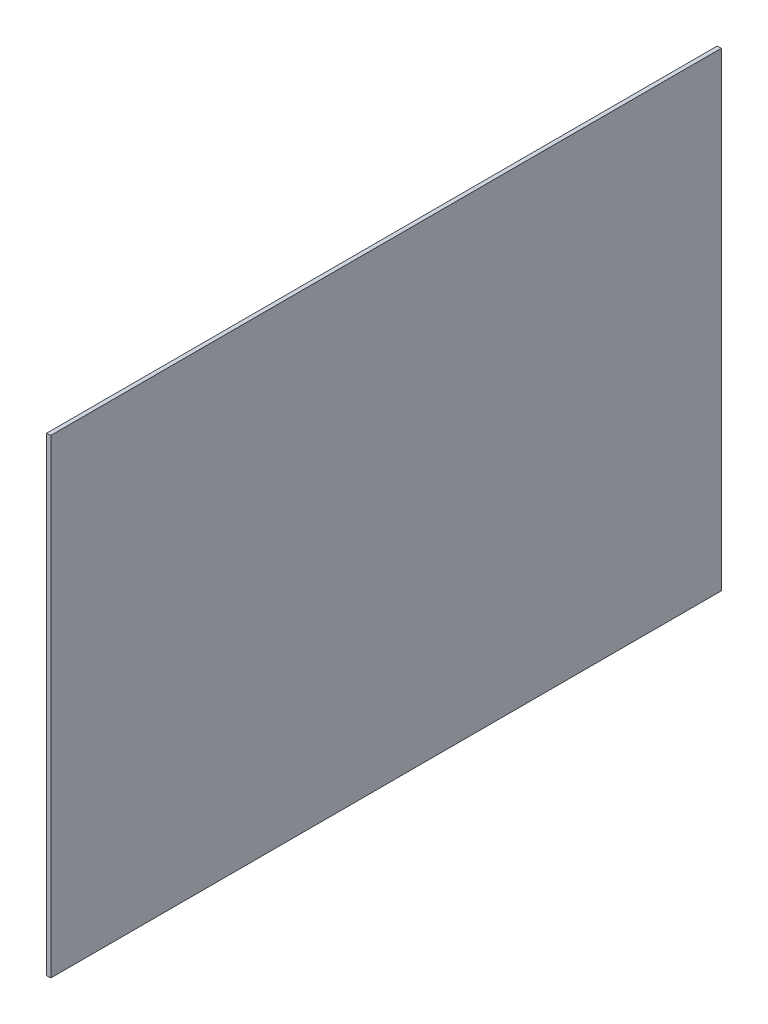
ISO-10303-21;
HEADER;
FILE_DESCRIPTION(('STEP AP214'),'2;1');
FILE_NAME('part.step','',(''),(''),'','','');
FILE_SCHEMA(('AUTOMOTIVE_DESIGN { 1 0 10303 214 1 1 1 1 }'));
ENDSEC;
DATA;
#1=APPLICATION_CONTEXT('core data for automotive mechanical design processes');
#2=APPLICATION_PROTOCOL_DEFINITION('international standard','automotive_design',2000,#1);
#3=PRODUCT_CONTEXT('',#1,'mechanical');
#4=PRODUCT('Part','Part','',(#3));
#5=PRODUCT_RELATED_PRODUCT_CATEGORY('part','',(#4));
#6=PRODUCT_DEFINITION_FORMATION('','',#4);
#7=PRODUCT_DEFINITION_CONTEXT('part definition',#1,'design');
#8=PRODUCT_DEFINITION('design','',#6,#7);
#9=PRODUCT_DEFINITION_SHAPE('','',#8);
#10=(LENGTH_UNIT() NAMED_UNIT(*) SI_UNIT(.MILLI.,.METRE.));
#11=(NAMED_UNIT(*) PLANE_ANGLE_UNIT() SI_UNIT($,.RADIAN.));
#12=(NAMED_UNIT(*) SI_UNIT($,.STERADIAN.) SOLID_ANGLE_UNIT());
#13=UNCERTAINTY_MEASURE_WITH_UNIT(LENGTH_MEASURE(1.E-05),#10,'distance_accuracy_value','');
#14=(GEOMETRIC_REPRESENTATION_CONTEXT(3) GLOBAL_UNCERTAINTY_ASSIGNED_CONTEXT((#13)) GLOBAL_UNIT_ASSIGNED_CONTEXT((#10,
#11,#12)) REPRESENTATION_CONTEXT('',''));
#15=CARTESIAN_POINT('',(0.,0.,0.));
#16=DIRECTION('',(0.,0.,1.));
#17=DIRECTION('',(1.,0.,0.));
#18=AXIS2_PLACEMENT_3D('',#15,#16,#17);
#19=CARTESIAN_POINT('',(3.,175.205305412168,-250.));
#20=DIRECTION('',(0.,-1.,0.));
#21=DIRECTION('',(0.,0.,-1.));
#22=AXIS2_PLACEMENT_3D('',#19,#20,#21);
#23=PLANE('',#22);
#24=DIRECTION('',(0.,0.,1.));
#25=VECTOR('',#24,1.);
#26=CARTESIAN_POINT('',(0.,175.205305412168,-250.));
#27=LINE('',#26,#25);
#28=CARTESIAN_POINT('',(0.,175.205305412168,-250.));
#29=VERTEX_POINT('',#28);
#30=CARTESIAN_POINT('',(0.,175.205305412168,250.));
#31=VERTEX_POINT('',#30);
#32=EDGE_CURVE('E96',#29,#31,#27,.T.);
#33=ORIENTED_EDGE('',*,*,#32,.T.);
#34=DIRECTION('',(-1.,0.,0.));
#35=VECTOR('',#34,1.);
#36=CARTESIAN_POINT('',(3.,175.205305412168,250.));
#37=LINE('',#36,#35);
#38=CARTESIAN_POINT('',(3.,175.205305412168,250.));
#39=VERTEX_POINT('',#38);
#40=EDGE_CURVE('E11',#39,#31,#37,.T.);
#41=ORIENTED_EDGE('',*,*,#40,.F.);
#42=DIRECTION('',(0.,0.,1.));
#43=VECTOR('',#42,1.);
#44=CARTESIAN_POINT('',(3.,175.205305412168,-250.));
#45=LINE('',#44,#43);
#46=CARTESIAN_POINT('',(3.,175.205305412168,-250.));
#47=VERTEX_POINT('',#46);
#48=EDGE_CURVE('E84',#47,#39,#45,.T.);
#49=ORIENTED_EDGE('',*,*,#48,.F.);
#50=DIRECTION('',(-1.,0.,0.));
#51=VECTOR('',#50,1.);
#52=CARTESIAN_POINT('',(3.,175.205305412168,-250.));
#53=LINE('',#52,#51);
#54=EDGE_CURVE('E92',#47,#29,#53,.T.);
#55=ORIENTED_EDGE('',*,*,#54,.T.);
#56=EDGE_LOOP('',(#33,#41,#49,#55));
#57=FACE_BOUND('',#56,.T.);
#58=ADVANCED_FACE('F33',(#57),#23,.F.);
#59=CARTESIAN_POINT('',(3.,175.205305412168,250.));
#60=DIRECTION('',(0.,0.,-1.));
#61=DIRECTION('',(-1.,0.,0.));
#62=AXIS2_PLACEMENT_3D('',#59,#60,#61);
#63=PLANE('',#62);
#64=DIRECTION('',(0.,-1.,0.));
#65=VECTOR('',#64,1.);
#66=CARTESIAN_POINT('',(0.,175.205305412168,250.));
#67=LINE('',#66,#65);
#68=CARTESIAN_POINT('',(0.,-175.205305412168,250.));
#69=VERTEX_POINT('',#68);
#70=EDGE_CURVE('E88',#31,#69,#67,.T.);
#71=ORIENTED_EDGE('',*,*,#70,.T.);
#72=DIRECTION('',(-1.,0.,0.));
#73=VECTOR('',#72,1.);
#74=CARTESIAN_POINT('',(3.,-175.205305412168,250.));
#75=LINE('',#74,#73);
#76=CARTESIAN_POINT('',(3.,-175.205305412168,250.));
#77=VERTEX_POINT('',#76);
#78=EDGE_CURVE('E41',#77,#69,#75,.T.);
#79=ORIENTED_EDGE('',*,*,#78,.F.);
#80=DIRECTION('',(0.,-1.,0.));
#81=VECTOR('',#80,1.);
#82=CARTESIAN_POINT('',(3.,175.205305412168,250.));
#83=LINE('',#82,#81);
#84=EDGE_CURVE('E79',#39,#77,#83,.T.);
#85=ORIENTED_EDGE('',*,*,#84,.F.);
#86=ORIENTED_EDGE('',*,*,#40,.T.);
#87=EDGE_LOOP('',(#71,#79,#85,#86));
#88=FACE_BOUND('',#87,.T.);
#89=ADVANCED_FACE('F87',(#88),#63,.F.);
#90=CARTESIAN_POINT('',(3.,-175.205305412168,250.));
#91=DIRECTION('',(0.,1.,0.));
#92=DIRECTION('',(0.,0.,1.));
#93=AXIS2_PLACEMENT_3D('',#90,#91,#92);
#94=PLANE('',#93);
#95=DIRECTION('',(0.,0.,-1.));
#96=VECTOR('',#95,1.);
#97=CARTESIAN_POINT('',(0.,-175.205305412168,250.));
#98=LINE('',#97,#96);
#99=CARTESIAN_POINT('',(0.,-175.205305412168,-250.));
#100=VERTEX_POINT('',#99);
#101=EDGE_CURVE('E66',#69,#100,#98,.T.);
#102=ORIENTED_EDGE('',*,*,#101,.T.);
#103=DIRECTION('',(-1.,0.,0.));
#104=VECTOR('',#103,1.);
#105=CARTESIAN_POINT('',(3.,-175.205305412168,-250.));
#106=LINE('',#105,#104);
#107=CARTESIAN_POINT('',(3.,-175.205305412168,-250.));
#108=VERTEX_POINT('',#107);
#109=EDGE_CURVE('E89',#108,#100,#106,.T.);
#110=ORIENTED_EDGE('',*,*,#109,.F.);
#111=DIRECTION('',(0.,0.,-1.));
#112=VECTOR('',#111,1.);
#113=CARTESIAN_POINT('',(3.,-175.205305412168,250.));
#114=LINE('',#113,#112);
#115=EDGE_CURVE('E82',#77,#108,#114,.T.);
#116=ORIENTED_EDGE('',*,*,#115,.F.);
#117=ORIENTED_EDGE('',*,*,#78,.T.);
#118=EDGE_LOOP('',(#102,#110,#116,#117));
#119=FACE_BOUND('',#118,.T.);
#120=ADVANCED_FACE('F90',(#119),#94,.F.);
#121=CARTESIAN_POINT('',(3.,-175.205305412168,-250.));
#122=DIRECTION('',(0.,0.,1.));
#123=DIRECTION('',(1.,0.,0.));
#124=AXIS2_PLACEMENT_3D('',#121,#122,#123);
#125=PLANE('',#124);
#126=DIRECTION('',(0.,1.,0.));
#127=VECTOR('',#126,1.);
#128=CARTESIAN_POINT('',(0.,-175.205305412168,-250.));
#129=LINE('',#128,#127);
#130=EDGE_CURVE('E72',#100,#29,#129,.T.);
#131=ORIENTED_EDGE('',*,*,#130,.T.);
#132=ORIENTED_EDGE('',*,*,#54,.F.);
#133=DIRECTION('',(0.,1.,0.));
#134=VECTOR('',#133,1.);
#135=CARTESIAN_POINT('',(3.,-175.205305412168,-250.));
#136=LINE('',#135,#134);
#137=EDGE_CURVE('E49',#108,#47,#136,.T.);
#138=ORIENTED_EDGE('',*,*,#137,.F.);
#139=ORIENTED_EDGE('',*,*,#109,.T.);
#140=EDGE_LOOP('',(#131,#132,#138,#139));
#141=FACE_BOUND('',#140,.T.);
#142=ADVANCED_FACE('F103',(#141),#125,.F.);
#143=CARTESIAN_POINT('',(3.,0.,0.));
#144=DIRECTION('',(1.,0.,0.));
#145=DIRECTION('',(0.,0.,-1.));
#146=AXIS2_PLACEMENT_3D('',#143,#144,#145);
#147=PLANE('',#146);
#148=ORIENTED_EDGE('',*,*,#48,.T.);
#149=ORIENTED_EDGE('',*,*,#84,.T.);
#150=ORIENTED_EDGE('',*,*,#115,.T.);
#151=ORIENTED_EDGE('',*,*,#137,.T.);
#152=EDGE_LOOP('',(#148,#149,#150,#151));
#153=FACE_BOUND('',#152,.T.);
#154=ADVANCED_FACE('F80',(#153),#147,.T.);
#155=CARTESIAN_POINT('',(0.,0.,0.));
#156=DIRECTION('',(1.,0.,0.));
#157=DIRECTION('',(0.,0.,-1.));
#158=AXIS2_PLACEMENT_3D('',#155,#156,#157);
#159=PLANE('',#158);
#160=ORIENTED_EDGE('',*,*,#32,.F.);
#161=ORIENTED_EDGE('',*,*,#130,.F.);
#162=ORIENTED_EDGE('',*,*,#101,.F.);
#163=ORIENTED_EDGE('',*,*,#70,.F.);
#164=EDGE_LOOP('',(#160,#161,#162,#163));
#165=FACE_BOUND('',#164,.T.);
#166=ADVANCED_FACE('F106',(#165),#159,.F.);
#167=CLOSED_SHELL('',(#58,#89,#120,#142,#154,#166));
#168=MANIFOLD_SOLID_BREP('B2',#167);
#169=ADVANCED_BREP_SHAPE_REPRESENTATION('',(#18,#168),#14);
#170=SHAPE_DEFINITION_REPRESENTATION(#9,#169);
ENDSEC;
END-ISO-10303-21;
